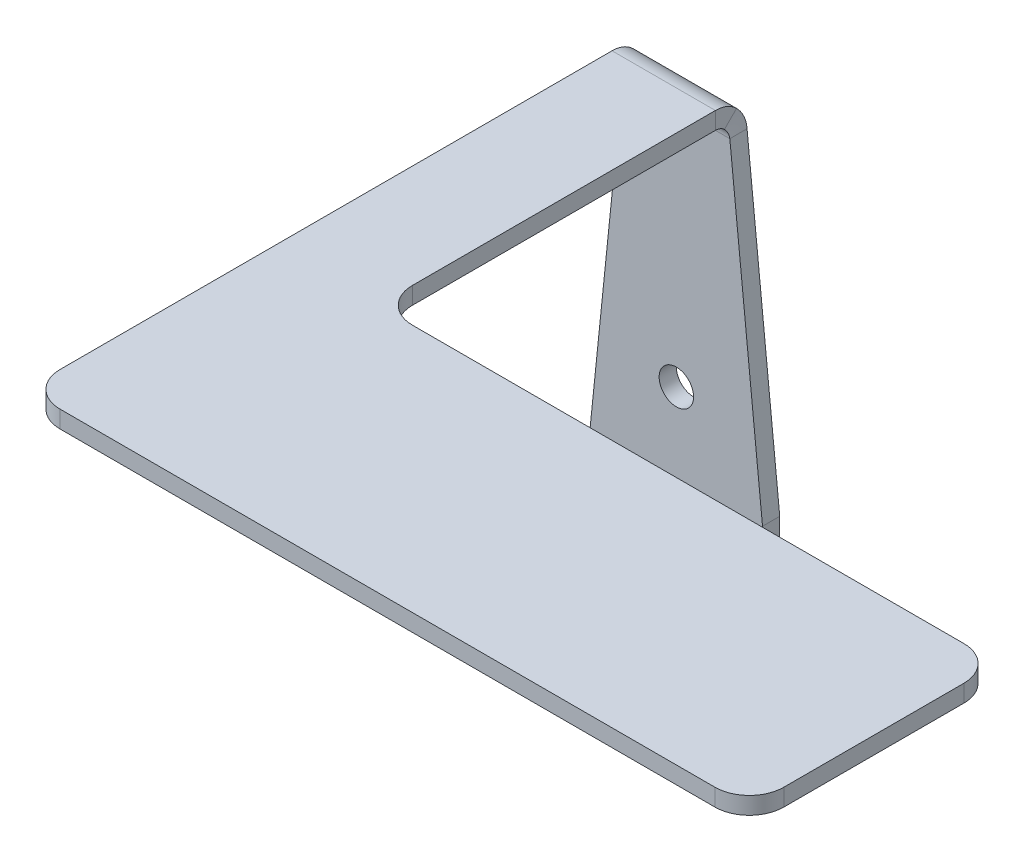
ISO-10303-21;
HEADER;
FILE_DESCRIPTION(('STEP AP214'),'2;1');
FILE_NAME('part.step','',(''),(''),'','','');
FILE_SCHEMA(('AUTOMOTIVE_DESIGN { 1 0 10303 214 1 1 1 1 }'));
ENDSEC;
DATA;
#1=APPLICATION_CONTEXT('core data for automotive mechanical design processes');
#2=APPLICATION_PROTOCOL_DEFINITION('international standard','automotive_design',2000,#1);
#3=PRODUCT_CONTEXT('',#1,'mechanical');
#4=PRODUCT('Part','Part','',(#3));
#5=PRODUCT_RELATED_PRODUCT_CATEGORY('part','',(#4));
#6=PRODUCT_DEFINITION_FORMATION('','',#4);
#7=PRODUCT_DEFINITION_CONTEXT('part definition',#1,'design');
#8=PRODUCT_DEFINITION('design','',#6,#7);
#9=PRODUCT_DEFINITION_SHAPE('','',#8);
#10=(LENGTH_UNIT() NAMED_UNIT(*) SI_UNIT(.MILLI.,.METRE.));
#11=(NAMED_UNIT(*) PLANE_ANGLE_UNIT() SI_UNIT($,.RADIAN.));
#12=(NAMED_UNIT(*) SI_UNIT($,.STERADIAN.) SOLID_ANGLE_UNIT());
#13=UNCERTAINTY_MEASURE_WITH_UNIT(LENGTH_MEASURE(1.E-05),#10,'distance_accuracy_value','');
#14=(GEOMETRIC_REPRESENTATION_CONTEXT(3) GLOBAL_UNCERTAINTY_ASSIGNED_CONTEXT((#13)) GLOBAL_UNIT_ASSIGNED_CONTEXT((#10,
#11,#12)) REPRESENTATION_CONTEXT('',''));
#15=CARTESIAN_POINT('',(0.,0.,0.));
#16=DIRECTION('',(0.,0.,1.));
#17=DIRECTION('',(1.,0.,0.));
#18=AXIS2_PLACEMENT_3D('',#15,#16,#17);
#19=CARTESIAN_POINT('',(42.1509861979315,14.5038150311188,32.7652042118766));
#20=DIRECTION('',(-1.,0.,0.));
#21=DIRECTION('',(0.,-1.,0.));
#22=AXIS2_PLACEMENT_3D('',#19,#20,#21);
#23=PLANE('',#22);
#24=DIRECTION('',(0.,0.,-1.));
#25=VECTOR('',#24,1.);
#26=CARTESIAN_POINT('',(42.1509861979315,14.5038150311188,32.7652042118766));
#27=LINE('',#26,#25);
#28=CARTESIAN_POINT('',(42.1509861979315,14.5038150311188,32.7652042118766));
#29=VERTEX_POINT('',#28);
#30=CARTESIAN_POINT('',(42.1509861979315,14.5038150311189,0.736600000000007));
#31=VERTEX_POINT('',#30);
#32=EDGE_CURVE('E164',#29,#31,#27,.T.);
#33=ORIENTED_EDGE('',*,*,#32,.T.);
#34=DIRECTION('',(0.,-1.,0.));
#35=VECTOR('',#34,1.);
#36=CARTESIAN_POINT('',(42.1509861979315,14.5038150311189,0.736600000000007));
#37=LINE('',#36,#35);
#38=CARTESIAN_POINT('',(42.1509861979315,13.5038150311189,0.736600000000001));
#39=VERTEX_POINT('',#38);
#40=EDGE_CURVE('E12',#31,#39,#37,.T.);
#41=ORIENTED_EDGE('',*,*,#40,.T.);
#42=DIRECTION('',(0.,0.,-1.));
#43=VECTOR('',#42,1.);
#44=CARTESIAN_POINT('',(42.1509861979315,13.5038150311188,32.7652042118766));
#45=LINE('',#44,#43);
#46=CARTESIAN_POINT('',(42.1509861979315,13.5038150311188,32.7652042118766));
#47=VERTEX_POINT('',#46);
#48=EDGE_CURVE('E191',#47,#39,#45,.T.);
#49=ORIENTED_EDGE('',*,*,#48,.F.);
#50=DIRECTION('',(0.,-1.,0.));
#51=VECTOR('',#50,1.);
#52=CARTESIAN_POINT('',(42.1509861979315,14.5038150311188,32.7652042118766));
#53=LINE('',#52,#51);
#54=EDGE_CURVE('E152',#29,#47,#53,.T.);
#55=ORIENTED_EDGE('',*,*,#54,.F.);
#56=EDGE_LOOP('',(#33,#41,#49,#55));
#57=FACE_BOUND('',#56,.T.);
#58=ADVANCED_FACE('F56',(#57),#23,.T.);
#59=CARTESIAN_POINT('',(48.1509861979315,14.5038150311188,18.319635118458));
#60=DIRECTION('',(1.,0.,0.));
#61=DIRECTION('',(0.,0.,1.));
#62=AXIS2_PLACEMENT_3D('',#59,#60,#61);
#63=PLANE('',#62);
#64=DIRECTION('',(0.,0.,1.));
#65=VECTOR('',#64,1.);
#66=CARTESIAN_POINT('',(48.1509861979315,13.5038150311188,18.319635118458));
#67=LINE('',#66,#65);
#68=CARTESIAN_POINT('',(48.1509861979315,13.5038150311189,0.736600000000001));
#69=VERTEX_POINT('',#68);
#70=CARTESIAN_POINT('',(48.1509861979315,13.5038150311188,18.319635118458));
#71=VERTEX_POINT('',#70);
#72=EDGE_CURVE('E115',#69,#71,#67,.T.);
#73=ORIENTED_EDGE('',*,*,#72,.F.);
#74=DIRECTION('',(0.,1.,0.));
#75=VECTOR('',#74,1.);
#76=CARTESIAN_POINT('',(48.1509861979315,14.5038150311189,0.736600000000006));
#77=LINE('',#76,#75);
#78=CARTESIAN_POINT('',(48.1509861979315,14.5038150311189,0.736600000000002));
#79=VERTEX_POINT('',#78);
#80=EDGE_CURVE('E205',#69,#79,#77,.T.);
#81=ORIENTED_EDGE('',*,*,#80,.T.);
#82=DIRECTION('',(0.,0.,1.));
#83=VECTOR('',#82,1.);
#84=CARTESIAN_POINT('',(48.1509861979315,14.5038150311188,18.319635118458));
#85=LINE('',#84,#83);
#86=CARTESIAN_POINT('',(48.1509861979315,14.5038150311188,18.319635118458));
#87=VERTEX_POINT('',#86);
#88=EDGE_CURVE('E59',#79,#87,#85,.T.);
#89=ORIENTED_EDGE('',*,*,#88,.T.);
#90=DIRECTION('',(0.,-1.,0.));
#91=VECTOR('',#90,1.);
#92=CARTESIAN_POINT('',(48.1509861979315,14.5038150311188,18.319635118458));
#93=LINE('',#92,#91);
#94=EDGE_CURVE('E192',#87,#71,#93,.T.);
#95=ORIENTED_EDGE('',*,*,#94,.T.);
#96=EDGE_LOOP('',(#73,#81,#89,#95));
#97=FACE_BOUND('',#96,.T.);
#98=ADVANCED_FACE('F240',(#97),#63,.T.);
#99=CARTESIAN_POINT('',(50.1509861979315,14.5038150311188,18.319635118458));
#100=DIRECTION('',(0.,1.,0.));
#101=DIRECTION('',(-1.,0.,0.));
#102=AXIS2_PLACEMENT_3D('',#99,#100,#101);
#103=PLANE('',#102);
#104=ORIENTED_EDGE('',*,*,#88,.F.);
#105=DIRECTION('',(-1.,0.,0.));
#106=VECTOR('',#105,1.);
#107=CARTESIAN_POINT('',(50.1509861979315,14.5038150311189,0.736600000000006));
#108=LINE('',#107,#106);
#109=EDGE_CURVE('E194',#79,#31,#108,.T.);
#110=ORIENTED_EDGE('',*,*,#109,.T.);
#111=ORIENTED_EDGE('',*,*,#32,.F.);
#112=CARTESIAN_POINT('',(44.1509861979315,14.5038150311188,32.7652042118766));
#113=DIRECTION('',(0.,-1.,0.));
#114=DIRECTION('',(-1.,0.,0.));
#115=AXIS2_PLACEMENT_3D('',#112,#113,#114);
#116=CIRCLE('',#115,2.);
#117=CARTESIAN_POINT('',(44.1509861979315,14.5038150311188,34.7652042118766));
#118=VERTEX_POINT('',#117);
#119=EDGE_CURVE('E145',#118,#29,#116,.T.);
#120=ORIENTED_EDGE('',*,*,#119,.F.);
#121=DIRECTION('',(-1.,0.,0.));
#122=VECTOR('',#121,1.);
#123=CARTESIAN_POINT('',(44.1509861979315,14.5038150311188,34.7652042118766));
#124=LINE('',#123,#122);
#125=CARTESIAN_POINT('',(82.1509861979315,14.5038150311188,34.7652042118766));
#126=VERTEX_POINT('',#125);
#127=EDGE_CURVE('E160',#126,#118,#124,.T.);
#128=ORIENTED_EDGE('',*,*,#127,.F.);
#129=CARTESIAN_POINT('',(82.1509861979315,14.5038150311188,32.7652042118766));
#130=DIRECTION('',(0.,-1.,0.));
#131=DIRECTION('',(-1.,0.,0.));
#132=AXIS2_PLACEMENT_3D('',#129,#130,#131);
#133=CIRCLE('',#132,2.);
#134=CARTESIAN_POINT('',(84.1509861979315,14.5038150311188,32.7652042118766));
#135=VERTEX_POINT('',#134);
#136=EDGE_CURVE('E167',#135,#126,#133,.T.);
#137=ORIENTED_EDGE('',*,*,#136,.F.);
#138=DIRECTION('',(0.,0.,1.));
#139=VECTOR('',#138,1.);
#140=CARTESIAN_POINT('',(84.1509861979315,14.5038150311188,32.7652042118766));
#141=LINE('',#140,#139);
#142=CARTESIAN_POINT('',(84.1509861979315,14.5038150311188,22.319635118458));
#143=VERTEX_POINT('',#142);
#144=EDGE_CURVE('E169',#143,#135,#141,.T.);
#145=ORIENTED_EDGE('',*,*,#144,.F.);
#146=CARTESIAN_POINT('',(82.1509861979315,14.5038150311188,22.319635118458));
#147=DIRECTION('',(0.,-1.,0.));
#148=DIRECTION('',(1.,0.,0.));
#149=AXIS2_PLACEMENT_3D('',#146,#147,#148);
#150=CIRCLE('',#149,2.);
#151=CARTESIAN_POINT('',(82.1509861979315,14.5038150311188,20.319635118458));
#152=VERTEX_POINT('',#151);
#153=EDGE_CURVE('E217',#152,#143,#150,.T.);
#154=ORIENTED_EDGE('',*,*,#153,.F.);
#155=DIRECTION('',(1.,0.,0.));
#156=VECTOR('',#155,1.);
#157=CARTESIAN_POINT('',(82.1509861979315,14.5038150311188,20.319635118458));
#158=LINE('',#157,#156);
#159=CARTESIAN_POINT('',(50.1509861979315,14.5038150311188,20.319635118458));
#160=VERTEX_POINT('',#159);
#161=EDGE_CURVE('E213',#160,#152,#158,.T.);
#162=ORIENTED_EDGE('',*,*,#161,.F.);
#163=CARTESIAN_POINT('',(50.1509861979315,14.5038150311188,18.319635118458));
#164=DIRECTION('',(0.,1.,0.));
#165=DIRECTION('',(-1.,0.,0.));
#166=AXIS2_PLACEMENT_3D('',#163,#164,#165);
#167=CIRCLE('',#166,2.);
#168=EDGE_CURVE('E211',#87,#160,#167,.T.);
#169=ORIENTED_EDGE('',*,*,#168,.F.);
#170=EDGE_LOOP('',(#104,#110,#111,#120,#128,#137,#145,#154,#162,#169));
#171=FACE_BOUND('',#170,.T.);
#172=ADVANCED_FACE('F158',(#171),#103,.T.);
#173=CARTESIAN_POINT('',(50.1509861979315,14.5038150311188,18.319635118458));
#174=DIRECTION('',(0.,-1.,0.));
#175=DIRECTION('',(1.,0.,0.));
#176=AXIS2_PLACEMENT_3D('',#173,#174,#175);
#177=CYLINDRICAL_SURFACE('',#176,2.);
#178=CARTESIAN_POINT('',(50.1509861979315,13.5038150311188,18.319635118458));
#179=DIRECTION('',(0.,1.,0.));
#180=DIRECTION('',(-1.,0.,0.));
#181=AXIS2_PLACEMENT_3D('',#178,#179,#180);
#182=CIRCLE('',#181,2.);
#183=CARTESIAN_POINT('',(50.1509861979315,13.5038150311188,20.319635118458));
#184=VERTEX_POINT('',#183);
#185=EDGE_CURVE('E173',#71,#184,#182,.T.);
#186=ORIENTED_EDGE('',*,*,#185,.F.);
#187=ORIENTED_EDGE('',*,*,#94,.F.);
#188=ORIENTED_EDGE('',*,*,#168,.T.);
#189=DIRECTION('',(0.,-1.,0.));
#190=VECTOR('',#189,1.);
#191=CARTESIAN_POINT('',(50.1509861979315,14.5038150311188,20.319635118458));
#192=LINE('',#191,#190);
#193=EDGE_CURVE('E122',#160,#184,#192,.T.);
#194=ORIENTED_EDGE('',*,*,#193,.T.);
#195=EDGE_LOOP('',(#186,#187,#188,#194));
#196=FACE_BOUND('',#195,.T.);
#197=ADVANCED_FACE('F459',(#196),#177,.F.);
#198=CARTESIAN_POINT('',(44.1509861979315,14.5038150311188,32.7652042118766));
#199=DIRECTION('',(0.,-1.,0.));
#200=DIRECTION('',(1.,0.,0.));
#201=AXIS2_PLACEMENT_3D('',#198,#199,#200);
#202=CYLINDRICAL_SURFACE('',#201,2.);
#203=CARTESIAN_POINT('',(44.1509861979315,13.5038150311188,32.7652042118766));
#204=DIRECTION('',(0.,-1.,0.));
#205=DIRECTION('',(-1.,0.,0.));
#206=AXIS2_PLACEMENT_3D('',#203,#204,#205);
#207=CIRCLE('',#206,2.);
#208=CARTESIAN_POINT('',(44.1509861979315,13.5038150311188,34.7652042118766));
#209=VERTEX_POINT('',#208);
#210=EDGE_CURVE('E147',#209,#47,#207,.T.);
#211=ORIENTED_EDGE('',*,*,#210,.F.);
#212=DIRECTION('',(0.,-1.,0.));
#213=VECTOR('',#212,1.);
#214=CARTESIAN_POINT('',(44.1509861979315,14.5038150311188,34.7652042118766));
#215=LINE('',#214,#213);
#216=EDGE_CURVE('E142',#118,#209,#215,.T.);
#217=ORIENTED_EDGE('',*,*,#216,.F.);
#218=ORIENTED_EDGE('',*,*,#119,.T.);
#219=ORIENTED_EDGE('',*,*,#54,.T.);
#220=EDGE_LOOP('',(#211,#217,#218,#219));
#221=FACE_BOUND('',#220,.T.);
#222=ADVANCED_FACE('F144',(#221),#202,.T.);
#223=CARTESIAN_POINT('',(44.1509861979315,14.5038150311188,34.7652042118766));
#224=DIRECTION('',(0.,0.,1.));
#225=DIRECTION('',(-1.,0.,0.));
#226=AXIS2_PLACEMENT_3D('',#223,#224,#225);
#227=PLANE('',#226);
#228=DIRECTION('',(-1.,0.,0.));
#229=VECTOR('',#228,1.);
#230=CARTESIAN_POINT('',(44.1509861979315,13.5038150311188,34.7652042118766));
#231=LINE('',#230,#229);
#232=CARTESIAN_POINT('',(82.1509861979315,13.5038150311188,34.7652042118766));
#233=VERTEX_POINT('',#232);
#234=EDGE_CURVE('E188',#233,#209,#231,.T.);
#235=ORIENTED_EDGE('',*,*,#234,.F.);
#236=DIRECTION('',(0.,-1.,0.));
#237=VECTOR('',#236,1.);
#238=CARTESIAN_POINT('',(82.1509861979315,14.5038150311188,34.7652042118766));
#239=LINE('',#238,#237);
#240=EDGE_CURVE('E153',#126,#233,#239,.T.);
#241=ORIENTED_EDGE('',*,*,#240,.F.);
#242=ORIENTED_EDGE('',*,*,#127,.T.);
#243=ORIENTED_EDGE('',*,*,#216,.T.);
#244=EDGE_LOOP('',(#235,#241,#242,#243));
#245=FACE_BOUND('',#244,.T.);
#246=ADVANCED_FACE('F166',(#245),#227,.T.);
#247=CARTESIAN_POINT('',(82.1509861979315,14.5038150311188,32.7652042118766));
#248=DIRECTION('',(0.,-1.,0.));
#249=DIRECTION('',(1.,0.,0.));
#250=AXIS2_PLACEMENT_3D('',#247,#248,#249);
#251=CYLINDRICAL_SURFACE('',#250,2.);
#252=CARTESIAN_POINT('',(82.1509861979315,13.5038150311188,32.7652042118766));
#253=DIRECTION('',(0.,-1.,0.));
#254=DIRECTION('',(-1.,0.,0.));
#255=AXIS2_PLACEMENT_3D('',#252,#253,#254);
#256=CIRCLE('',#255,2.);
#257=CARTESIAN_POINT('',(84.1509861979315,13.5038150311188,32.7652042118766));
#258=VERTEX_POINT('',#257);
#259=EDGE_CURVE('E185',#258,#233,#256,.T.);
#260=ORIENTED_EDGE('',*,*,#259,.F.);
#261=DIRECTION('',(0.,-1.,0.));
#262=VECTOR('',#261,1.);
#263=CARTESIAN_POINT('',(84.1509861979315,14.5038150311188,32.7652042118766));
#264=LINE('',#263,#262);
#265=EDGE_CURVE('E197',#135,#258,#264,.T.);
#266=ORIENTED_EDGE('',*,*,#265,.F.);
#267=ORIENTED_EDGE('',*,*,#136,.T.);
#268=ORIENTED_EDGE('',*,*,#240,.T.);
#269=EDGE_LOOP('',(#260,#266,#267,#268));
#270=FACE_BOUND('',#269,.T.);
#271=ADVANCED_FACE('F462',(#270),#251,.T.);
#272=CARTESIAN_POINT('',(84.1509861979315,14.5038150311188,32.7652042118766));
#273=DIRECTION('',(1.,0.,0.));
#274=DIRECTION('',(0.,1.,0.));
#275=AXIS2_PLACEMENT_3D('',#272,#273,#274);
#276=PLANE('',#275);
#277=DIRECTION('',(0.,0.,1.));
#278=VECTOR('',#277,1.);
#279=CARTESIAN_POINT('',(84.1509861979315,13.5038150311188,32.7652042118766));
#280=LINE('',#279,#278);
#281=CARTESIAN_POINT('',(84.1509861979315,13.5038150311188,22.319635118458));
#282=VERTEX_POINT('',#281);
#283=EDGE_CURVE('E182',#282,#258,#280,.T.);
#284=ORIENTED_EDGE('',*,*,#283,.F.);
#285=DIRECTION('',(0.,-1.,0.));
#286=VECTOR('',#285,1.);
#287=CARTESIAN_POINT('',(84.1509861979315,14.5038150311188,22.319635118458));
#288=LINE('',#287,#286);
#289=EDGE_CURVE('E199',#143,#282,#288,.T.);
#290=ORIENTED_EDGE('',*,*,#289,.F.);
#291=ORIENTED_EDGE('',*,*,#144,.T.);
#292=ORIENTED_EDGE('',*,*,#265,.T.);
#293=EDGE_LOOP('',(#284,#290,#291,#292));
#294=FACE_BOUND('',#293,.T.);
#295=ADVANCED_FACE('F228',(#294),#276,.T.);
#296=CARTESIAN_POINT('',(82.1509861979315,14.5038150311188,22.319635118458));
#297=DIRECTION('',(0.,-1.,0.));
#298=DIRECTION('',(1.,0.,0.));
#299=AXIS2_PLACEMENT_3D('',#296,#297,#298);
#300=CYLINDRICAL_SURFACE('',#299,2.);
#301=CARTESIAN_POINT('',(82.1509861979315,13.5038150311188,22.319635118458));
#302=DIRECTION('',(0.,-1.,0.));
#303=DIRECTION('',(1.,0.,0.));
#304=AXIS2_PLACEMENT_3D('',#301,#302,#303);
#305=CIRCLE('',#304,2.);
#306=CARTESIAN_POINT('',(82.1509861979315,13.5038150311188,20.319635118458));
#307=VERTEX_POINT('',#306);
#308=EDGE_CURVE('E179',#307,#282,#305,.T.);
#309=ORIENTED_EDGE('',*,*,#308,.F.);
#310=DIRECTION('',(0.,-1.,0.));
#311=VECTOR('',#310,1.);
#312=CARTESIAN_POINT('',(82.1509861979315,14.5038150311188,20.319635118458));
#313=LINE('',#312,#311);
#314=EDGE_CURVE('E201',#152,#307,#313,.T.);
#315=ORIENTED_EDGE('',*,*,#314,.F.);
#316=ORIENTED_EDGE('',*,*,#153,.T.);
#317=ORIENTED_EDGE('',*,*,#289,.T.);
#318=EDGE_LOOP('',(#309,#315,#316,#317));
#319=FACE_BOUND('',#318,.T.);
#320=ADVANCED_FACE('F233',(#319),#300,.T.);
#321=CARTESIAN_POINT('',(82.1509861979315,14.5038150311188,20.319635118458));
#322=DIRECTION('',(0.,0.,-1.));
#323=DIRECTION('',(1.,0.,0.));
#324=AXIS2_PLACEMENT_3D('',#321,#322,#323);
#325=PLANE('',#324);
#326=DIRECTION('',(1.,0.,0.));
#327=VECTOR('',#326,1.);
#328=CARTESIAN_POINT('',(82.1509861979315,13.5038150311188,20.319635118458));
#329=LINE('',#328,#327);
#330=EDGE_CURVE('E175',#184,#307,#329,.T.);
#331=ORIENTED_EDGE('',*,*,#330,.F.);
#332=ORIENTED_EDGE('',*,*,#193,.F.);
#333=ORIENTED_EDGE('',*,*,#161,.T.);
#334=ORIENTED_EDGE('',*,*,#314,.T.);
#335=EDGE_LOOP('',(#331,#332,#333,#334));
#336=FACE_BOUND('',#335,.T.);
#337=ADVANCED_FACE('F234',(#336),#325,.T.);
#338=CARTESIAN_POINT('',(50.1509861979315,13.5038150311188,18.319635118458));
#339=DIRECTION('',(0.,1.,0.));
#340=DIRECTION('',(-1.,0.,0.));
#341=AXIS2_PLACEMENT_3D('',#338,#339,#340);
#342=PLANE('',#341);
#343=DIRECTION('',(-1.,0.,0.));
#344=VECTOR('',#343,1.);
#345=CARTESIAN_POINT('',(50.1509861979315,13.5038150311189,0.736600000000002));
#346=LINE('',#345,#344);
#347=EDGE_CURVE('E64',#69,#39,#346,.T.);
#348=ORIENTED_EDGE('',*,*,#347,.F.);
#349=ORIENTED_EDGE('',*,*,#72,.T.);
#350=ORIENTED_EDGE('',*,*,#185,.T.);
#351=ORIENTED_EDGE('',*,*,#330,.T.);
#352=ORIENTED_EDGE('',*,*,#308,.T.);
#353=ORIENTED_EDGE('',*,*,#283,.T.);
#354=ORIENTED_EDGE('',*,*,#259,.T.);
#355=ORIENTED_EDGE('',*,*,#234,.T.);
#356=ORIENTED_EDGE('',*,*,#210,.T.);
#357=ORIENTED_EDGE('',*,*,#48,.T.);
#358=EDGE_LOOP('',(#348,#349,#350,#351,#352,#353,#354,#355,#356,#357));
#359=FACE_BOUND('',#358,.T.);
#360=ADVANCED_FACE('F380',(#359),#342,.F.);
#361=CARTESIAN_POINT('',(45.1482089892891,-13.7615616000238,-1.));
#362=DIRECTION('',(0.,0.,1.));
#363=DIRECTION('',(1.,0.,0.));
#364=AXIS2_PLACEMENT_3D('',#361,#362,#363);
#365=CYLINDRICAL_SURFACE('',#364,1.3999999999584);
#366=CARTESIAN_POINT('',(45.1482089892891,-13.7615616000238,-1.));
#367=DIRECTION('',(0.,0.,1.));
#368=DIRECTION('',(1.,0.,0.));
#369=AXIS2_PLACEMENT_3D('',#366,#367,#368);
#370=CIRCLE('',#369,1.3999999999584);
#371=CARTESIAN_POINT('',(46.5482089892475,-13.7615616000238,-1.));
#372=VERTEX_POINT('',#371);
#373=EDGE_CURVE('E528',#372,#372,#370,.T.);
#374=ORIENTED_EDGE('',*,*,#373,.F.);
#375=EDGE_LOOP('',(#374));
#376=FACE_BOUND('',#375,.T.);
#377=CARTESIAN_POINT('',(45.1482089892891,-13.7615616000238,0.));
#378=DIRECTION('',(0.,0.,1.));
#379=DIRECTION('',(1.,0.,0.));
#380=AXIS2_PLACEMENT_3D('',#377,#378,#379);
#381=CIRCLE('',#380,1.3999999999584);
#382=CARTESIAN_POINT('',(46.5482089892475,-13.7615616000238,0.));
#383=VERTEX_POINT('',#382);
#384=EDGE_CURVE('E533',#383,#383,#381,.T.);
#385=ORIENTED_EDGE('',*,*,#384,.T.);
#386=EDGE_LOOP('',(#385));
#387=FACE_BOUND('',#386,.T.);
#388=ADVANCED_FACE('F376',(#376,#387),#365,.F.);
#389=CARTESIAN_POINT('',(45.1482089892891,-1.26156160002384,-1.));
#390=DIRECTION('',(0.,0.,1.));
#391=DIRECTION('',(1.,0.,0.));
#392=AXIS2_PLACEMENT_3D('',#389,#390,#391);
#393=CYLINDRICAL_SURFACE('',#392,0.9999999999584);
#394=CARTESIAN_POINT('',(45.1482089892891,-1.26156160002384,-1.));
#395=DIRECTION('',(0.,0.,1.));
#396=DIRECTION('',(1.,0.,0.));
#397=AXIS2_PLACEMENT_3D('',#394,#395,#396);
#398=CIRCLE('',#397,0.9999999999584);
#399=CARTESIAN_POINT('',(46.1482089892475,-1.26156160002384,-1.));
#400=VERTEX_POINT('',#399);
#401=EDGE_CURVE('E815',#400,#400,#398,.T.);
#402=ORIENTED_EDGE('',*,*,#401,.F.);
#403=EDGE_LOOP('',(#402));
#404=FACE_BOUND('',#403,.T.);
#405=CARTESIAN_POINT('',(45.1482089892891,-1.26156160002384,0.));
#406=DIRECTION('',(0.,0.,1.));
#407=DIRECTION('',(1.,0.,0.));
#408=AXIS2_PLACEMENT_3D('',#405,#406,#407);
#409=CIRCLE('',#408,0.9999999999584);
#410=CARTESIAN_POINT('',(46.1482089892475,-1.26156160002384,0.));
#411=VERTEX_POINT('',#410);
#412=EDGE_CURVE('E799',#411,#411,#409,.T.);
#413=ORIENTED_EDGE('',*,*,#412,.T.);
#414=EDGE_LOOP('',(#413));
#415=FACE_BOUND('',#414,.T.);
#416=ADVANCED_FACE('F379',(#404,#415),#393,.F.);
#417=CARTESIAN_POINT('',(40.1482089892891,-5.76156160002383,-1.));
#418=DIRECTION('',(-1.,0.,0.));
#419=DIRECTION('',(0.,0.,1.));
#420=AXIS2_PLACEMENT_3D('',#417,#418,#419);
#421=PLANE('',#420);
#422=DIRECTION('',(0.,-1.,0.));
#423=VECTOR('',#422,1.);
#424=CARTESIAN_POINT('',(40.1482089892891,-5.76156160002383,0.));
#425=LINE('',#424,#423);
#426=CARTESIAN_POINT('',(40.1482089892891,-5.76156160002383,0.));
#427=VERTEX_POINT('',#426);
#428=CARTESIAN_POINT('',(40.1482089892891,-15.7615616000238,0.));
#429=VERTEX_POINT('',#428);
#430=EDGE_CURVE('E434',#427,#429,#425,.T.);
#431=ORIENTED_EDGE('',*,*,#430,.F.);
#432=DIRECTION('',(0.,0.,1.));
#433=VECTOR('',#432,1.);
#434=CARTESIAN_POINT('',(40.1482089892891,-5.76156160002383,-1.));
#435=LINE('',#434,#433);
#436=CARTESIAN_POINT('',(40.1482089892891,-5.76156160002383,-1.));
#437=VERTEX_POINT('',#436);
#438=EDGE_CURVE('E176',#437,#427,#435,.T.);
#439=ORIENTED_EDGE('',*,*,#438,.F.);
#440=DIRECTION('',(0.,-1.,0.));
#441=VECTOR('',#440,1.);
#442=CARTESIAN_POINT('',(40.1482089892891,-5.76156160002383,-1.));
#443=LINE('',#442,#441);
#444=CARTESIAN_POINT('',(40.1482089892891,-15.7615616000238,-1.));
#445=VERTEX_POINT('',#444);
#446=EDGE_CURVE('E828',#437,#445,#443,.T.);
#447=ORIENTED_EDGE('',*,*,#446,.T.);
#448=DIRECTION('',(0.,0.,1.));
#449=VECTOR('',#448,1.);
#450=CARTESIAN_POINT('',(40.1482089892891,-15.7615616000238,-1.));
#451=LINE('',#450,#449);
#452=EDGE_CURVE('E826',#445,#429,#451,.T.);
#453=ORIENTED_EDGE('',*,*,#452,.T.);
#454=EDGE_LOOP('',(#431,#439,#447,#453));
#455=FACE_BOUND('',#454,.T.);
#456=ADVANCED_FACE('F384',(#455),#421,.T.);
#457=CARTESIAN_POINT('',(45.1482089892891,-13.7615616000238,-1.));
#458=DIRECTION('',(0.,0.,1.));
#459=DIRECTION('',(1.,0.,0.));
#460=AXIS2_PLACEMENT_3D('',#457,#458,#459);
#461=CYLINDRICAL_SURFACE('',#460,5.3851648071345);
#462=CARTESIAN_POINT('',(45.1482089892891,-13.7615616000238,0.));
#463=DIRECTION('',(0.,0.,1.));
#464=DIRECTION('',(1.,0.,0.));
#465=AXIS2_PLACEMENT_3D('',#462,#463,#464);
#466=CIRCLE('',#465,5.3851648071345);
#467=CARTESIAN_POINT('',(50.1482089892891,-15.7615616000238,0.));
#468=VERTEX_POINT('',#467);
#469=EDGE_CURVE('E809',#429,#468,#466,.T.);
#470=ORIENTED_EDGE('',*,*,#469,.F.);
#471=ORIENTED_EDGE('',*,*,#452,.F.);
#472=CARTESIAN_POINT('',(45.1482089892891,-13.7615616000238,-1.));
#473=DIRECTION('',(0.,0.,1.));
#474=DIRECTION('',(1.,0.,0.));
#475=AXIS2_PLACEMENT_3D('',#472,#473,#474);
#476=CIRCLE('',#475,5.3851648071345);
#477=CARTESIAN_POINT('',(50.1482089892891,-15.7615616000238,-1.));
#478=VERTEX_POINT('',#477);
#479=EDGE_CURVE('E823',#445,#478,#476,.T.);
#480=ORIENTED_EDGE('',*,*,#479,.T.);
#481=DIRECTION('',(0.,0.,1.));
#482=VECTOR('',#481,1.);
#483=CARTESIAN_POINT('',(50.1482089892891,-15.7615616000238,-1.));
#484=LINE('',#483,#482);
#485=EDGE_CURVE('E821',#478,#468,#484,.T.);
#486=ORIENTED_EDGE('',*,*,#485,.T.);
#487=EDGE_LOOP('',(#470,#471,#480,#486));
#488=FACE_BOUND('',#487,.T.);
#489=ADVANCED_FACE('F388',(#488),#461,.T.);
#490=CARTESIAN_POINT('',(50.1482089892891,-5.76156160002383,-1.));
#491=DIRECTION('',(1.,0.,0.));
#492=DIRECTION('',(0.,0.,-1.));
#493=AXIS2_PLACEMENT_3D('',#490,#491,#492);
#494=PLANE('',#493);
#495=DIRECTION('',(0.,1.,0.));
#496=VECTOR('',#495,1.);
#497=CARTESIAN_POINT('',(50.1482089892891,-5.76156160002383,0.));
#498=LINE('',#497,#496);
#499=CARTESIAN_POINT('',(50.1482089892891,-5.76156160002383,0.));
#500=VERTEX_POINT('',#499);
#501=EDGE_CURVE('E806',#468,#500,#498,.T.);
#502=ORIENTED_EDGE('',*,*,#501,.F.);
#503=ORIENTED_EDGE('',*,*,#485,.F.);
#504=DIRECTION('',(0.,1.,0.));
#505=VECTOR('',#504,1.);
#506=CARTESIAN_POINT('',(50.1482089892891,-5.76156160002383,-1.));
#507=LINE('',#506,#505);
#508=CARTESIAN_POINT('',(50.1482089892891,-5.76156160002383,-1.));
#509=VERTEX_POINT('',#508);
#510=EDGE_CURVE('E819',#478,#509,#507,.T.);
#511=ORIENTED_EDGE('',*,*,#510,.T.);
#512=DIRECTION('',(0.,0.,1.));
#513=VECTOR('',#512,1.);
#514=CARTESIAN_POINT('',(50.1482089892891,-5.76156160002383,-1.));
#515=LINE('',#514,#513);
#516=EDGE_CURVE('E525',#509,#500,#515,.T.);
#517=ORIENTED_EDGE('',*,*,#516,.T.);
#518=EDGE_LOOP('',(#502,#503,#511,#517));
#519=FACE_BOUND('',#518,.T.);
#520=ADVANCED_FACE('F392',(#519),#494,.T.);
#521=CARTESIAN_POINT('',(50.1509861979315,32.2926968872914,-1.));
#522=DIRECTION('',(0.,0.,-1.));
#523=DIRECTION('',(-1.,0.,0.));
#524=AXIS2_PLACEMENT_3D('',#521,#522,#523);
#525=PLANE('',#524);
#526=DIRECTION('',(-1.,0.,0.));
#527=VECTOR('',#526,1.);
#528=CARTESIAN_POINT('',(50.1509861979315,12.7672150311189,-1.));
#529=LINE('',#528,#527);
#530=CARTESIAN_POINT('',(48.250460528587,12.7672150311189,-1.));
#531=VERTEX_POINT('',#530);
#532=CARTESIAN_POINT('',(42.0512352221547,12.7672150311189,-1.));
#533=VERTEX_POINT('',#532);
#534=EDGE_CURVE('E530',#531,#533,#529,.T.);
#535=ORIENTED_EDGE('',*,*,#534,.F.);
#536=DIRECTION('',(-0.101888659585818,0.994795808720466,0.));
#537=VECTOR('',#536,1.);
#538=CARTESIAN_POINT('',(50.1482089892891,-5.76156160002383,-1.));
#539=LINE('',#538,#537);
#540=EDGE_CURVE('E429',#509,#531,#539,.T.);
#541=ORIENTED_EDGE('',*,*,#540,.F.);
#542=ORIENTED_EDGE('',*,*,#510,.F.);
#543=ORIENTED_EDGE('',*,*,#479,.F.);
#544=ORIENTED_EDGE('',*,*,#446,.F.);
#545=DIRECTION('',(-0.102169065331331,-0.994767049157401,0.));
#546=VECTOR('',#545,1.);
#547=CARTESIAN_POINT('',(40.1482089892891,-5.76156160002383,-1.));
#548=LINE('',#547,#546);
#549=EDGE_CURVE('E447',#533,#437,#548,.T.);
#550=ORIENTED_EDGE('',*,*,#549,.F.);
#551=EDGE_LOOP('',(#535,#541,#542,#543,#544,#550));
#552=FACE_BOUND('',#551,.T.);
#553=ORIENTED_EDGE('',*,*,#401,.T.);
#554=EDGE_LOOP('',(#553));
#555=FACE_BOUND('',#554,.T.);
#556=ORIENTED_EDGE('',*,*,#373,.T.);
#557=EDGE_LOOP('',(#556));
#558=FACE_BOUND('',#557,.T.);
#559=ADVANCED_FACE('F396',(#552,#555,#558),#525,.T.);
#560=CARTESIAN_POINT('',(50.1482089892891,-5.76156160002383,-1.));
#561=DIRECTION('',(0.994795808720466,0.101888659585818,0.));
#562=DIRECTION('',(-0.101888659585818,0.994795808720466,0.));
#563=AXIS2_PLACEMENT_3D('',#560,#561,#562);
#564=PLANE('',#563);
#565=CARTESIAN_POINT('',(48.250460528587,12.7672150311189,0.));
#566=CARTESIAN_POINT('',(48.250460528587,12.7672150311189,-1.));
#567=B_SPLINE_CURVE_WITH_KNOTS('',1,(#565,#566),.UNSPECIFIED.,.F.,.F.,(2,2),(0.,1.),.UNSPECIFIED.);
#568=CARTESIAN_POINT('',(48.250460528587,12.7672150311189,0.));
#569=VERTEX_POINT('',#568);
#570=EDGE_CURVE('E524',#569,#531,#567,.T.);
#571=ORIENTED_EDGE('',*,*,#570,.F.);
#572=DIRECTION('',(-0.101888659585818,0.994795808720466,0.));
#573=VECTOR('',#572,1.);
#574=CARTESIAN_POINT('',(50.1482089892891,-5.76156160002383,0.));
#575=LINE('',#574,#573);
#576=EDGE_CURVE('E424',#500,#569,#575,.T.);
#577=ORIENTED_EDGE('',*,*,#576,.F.);
#578=ORIENTED_EDGE('',*,*,#516,.F.);
#579=ORIENTED_EDGE('',*,*,#540,.T.);
#580=EDGE_LOOP('',(#571,#577,#578,#579));
#581=FACE_BOUND('',#580,.T.);
#582=ADVANCED_FACE('F400',(#581),#564,.T.);
#583=CARTESIAN_POINT('',(50.1509861979315,32.2926968872914,0.));
#584=DIRECTION('',(0.,0.,-1.));
#585=DIRECTION('',(-1.,0.,0.));
#586=AXIS2_PLACEMENT_3D('',#583,#584,#585);
#587=PLANE('',#586);
#588=ORIENTED_EDGE('',*,*,#412,.F.);
#589=EDGE_LOOP('',(#588));
#590=FACE_BOUND('',#589,.T.);
#591=ORIENTED_EDGE('',*,*,#384,.F.);
#592=EDGE_LOOP('',(#591));
#593=FACE_BOUND('',#592,.T.);
#594=ORIENTED_EDGE('',*,*,#576,.T.);
#595=DIRECTION('',(-1.,0.,0.));
#596=VECTOR('',#595,1.);
#597=CARTESIAN_POINT('',(50.1509861979315,12.7672150311189,0.));
#598=LINE('',#597,#596);
#599=CARTESIAN_POINT('',(42.0512352221547,12.7672150311189,0.));
#600=VERTEX_POINT('',#599);
#601=EDGE_CURVE('E415',#569,#600,#598,.T.);
#602=ORIENTED_EDGE('',*,*,#601,.T.);
#603=DIRECTION('',(-0.102169065331331,-0.994767049157401,0.));
#604=VECTOR('',#603,1.);
#605=CARTESIAN_POINT('',(40.1482089892891,-5.76156160002383,0.));
#606=LINE('',#605,#604);
#607=EDGE_CURVE('E423',#600,#427,#606,.T.);
#608=ORIENTED_EDGE('',*,*,#607,.T.);
#609=ORIENTED_EDGE('',*,*,#430,.T.);
#610=ORIENTED_EDGE('',*,*,#469,.T.);
#611=ORIENTED_EDGE('',*,*,#501,.T.);
#612=EDGE_LOOP('',(#594,#602,#608,#609,#610,#611));
#613=FACE_BOUND('',#612,.T.);
#614=ADVANCED_FACE('F405',(#590,#593,#613),#587,.F.);
#615=CARTESIAN_POINT('',(40.1482089892891,-5.76156160002383,-1.));
#616=DIRECTION('',(-0.994767049157401,0.102169065331331,0.));
#617=DIRECTION('',(-0.102169065331331,-0.994767049157401,0.));
#618=AXIS2_PLACEMENT_3D('',#615,#616,#617);
#619=PLANE('',#618);
#620=CARTESIAN_POINT('',(42.0512352221547,12.7672150311189,-1.));
#621=CARTESIAN_POINT('',(42.0512352221547,12.7672150311189,0.));
#622=B_SPLINE_CURVE_WITH_KNOTS('',1,(#620,#621),.UNSPECIFIED.,.F.,.F.,(2,2),(0.,1.),.UNSPECIFIED.);
#623=EDGE_CURVE('E443',#533,#600,#622,.T.);
#624=ORIENTED_EDGE('',*,*,#623,.F.);
#625=ORIENTED_EDGE('',*,*,#549,.T.);
#626=ORIENTED_EDGE('',*,*,#438,.T.);
#627=ORIENTED_EDGE('',*,*,#607,.F.);
#628=EDGE_LOOP('',(#624,#625,#626,#627));
#629=FACE_BOUND('',#628,.T.);
#630=ADVANCED_FACE('F448',(#629),#619,.T.);
#631=CARTESIAN_POINT('',(48.1509861979315,12.7672150311189,0.7366));
#632=DIRECTION('',(1.,0.,0.));
#633=DIRECTION('',(0.,0.,-1.));
#634=AXIS2_PLACEMENT_3D('',#631,#632,#633);
#635=PLANE('',#634);
#636=ORIENTED_EDGE('',*,*,#80,.F.);
#637=CARTESIAN_POINT('',(48.1509861979315,12.7672150311189,0.7366));
#638=DIRECTION('',(1.,0.,0.));
#639=DIRECTION('',(0.,1.,0.));
#640=AXIS2_PLACEMENT_3D('',#637,#638,#639);
#641=CIRCLE('',#640,0.7366);
#642=CARTESIAN_POINT('',(48.1509861979315,13.2880698861409,0.215745144977989));
#643=VERTEX_POINT('',#642);
#644=EDGE_CURVE('E249',#69,#643,#641,.F.);
#645=ORIENTED_EDGE('',*,*,#644,.T.);
#646=CARTESIAN_POINT('',(48.1509861979315,13.9951766673274,-0.491361636208561));
#647=CARTESIAN_POINT('',(48.1509861979315,13.2880698861409,0.215745144977988));
#648=B_SPLINE_CURVE_WITH_KNOTS('',1,(#646,#647),.UNSPECIFIED.,.F.,.F.,(2,2),(0.,1.),.UNSPECIFIED.);
#649=CARTESIAN_POINT('',(48.1509861979315,13.9951766673274,-0.49136163620856));
#650=VERTEX_POINT('',#649);
#651=EDGE_CURVE('E327',#643,#650,#648,.F.);
#652=ORIENTED_EDGE('',*,*,#651,.T.);
#653=CARTESIAN_POINT('',(48.1509861979315,12.7672150311189,0.7366));
#654=DIRECTION('',(-1.,0.,0.));
#655=DIRECTION('',(0.,0.,-1.));
#656=AXIS2_PLACEMENT_3D('',#653,#654,#655);
#657=CIRCLE('',#656,1.7366);
#658=EDGE_CURVE('E251',#79,#650,#657,.T.);
#659=ORIENTED_EDGE('',*,*,#658,.F.);
#660=EDGE_LOOP('',(#636,#645,#652,#659));
#661=FACE_BOUND('',#660,.T.);
#662=ADVANCED_FACE('F246',(#661),#635,.T.);
#663=CARTESIAN_POINT('',(48.1509861979315,13.9951766673274,-0.491361636208561));
#664=CARTESIAN_POINT('',(48.1675682263836,13.8344080374172,-0.652130266118805));
#665=CARTESIAN_POINT('',(48.18414430815,13.641799752431,-0.780817442016006));
#666=CARTESIAN_POINT('',(48.2173024183685,13.2217664070972,-0.954800950302197));
#667=CARTESIAN_POINT('',(48.2338785001349,12.9945762079421,-1.));
#668=CARTESIAN_POINT('',(48.250460528587,12.7672150311189,-1.));
#669=CARTESIAN_POINT('',(48.1509861979315,13.2880698861409,0.215745144977988));
#670=CARTESIAN_POINT('',(48.1675681563624,13.2198782054266,0.147553464263664));
#671=CARTESIAN_POINT('',(48.18414430815,13.1381807720601,0.092968946338253));
#672=CARTESIAN_POINT('',(48.2173024183685,12.9600185227379,0.0191717263661185));
#673=CARTESIAN_POINT('',(48.2338785701561,12.8636526308261,0.));
#674=CARTESIAN_POINT('',(48.250460528587,12.7672150311189,0.));
#675=B_SPLINE_SURFACE_WITH_KNOTS('',1,3,((#663,#664,#665,#666,#667,#668),(#669,#670,#671,#672,
#673,#674)),.UNSPECIFIED.,.F.,.F.,.F.,(2,2),(4,2,4),(0.,1.),(0.,0.5,1.),.UNSPECIFIED.);
#676=CARTESIAN_POINT('',(48.1509861979315,13.2880698861409,0.215745144977988));
#677=CARTESIAN_POINT('',(48.1675681563624,13.2198782054266,0.147553464263664));
#678=CARTESIAN_POINT('',(48.18414430815,13.1381807720601,0.092968946338253));
#679=CARTESIAN_POINT('',(48.2173024183685,12.9600185227379,0.0191717263661185));
#680=CARTESIAN_POINT('',(48.2338785701561,12.8636526308261,0.));
#681=CARTESIAN_POINT('',(48.250460528587,12.7672150311189,0.));
#682=B_SPLINE_CURVE_WITH_KNOTS('',3,(#676,#677,#678,#679,#680,#681),.UNSPECIFIED.,.F.,.F.,(4,2,
4),(0.,0.5,1.),.UNSPECIFIED.);
#683=EDGE_CURVE('E262',#643,#569,#682,.T.);
#684=CARTESIAN_POINT('',(48.250460528587,12.7672150311189,-1.));
#685=CARTESIAN_POINT('',(48.2338785001349,12.9945762079421,-1.));
#686=CARTESIAN_POINT('',(48.2173024183685,13.2217664070972,-0.954800950302197));
#687=CARTESIAN_POINT('',(48.18414430815,13.641799752431,-0.780817442016006));
#688=CARTESIAN_POINT('',(48.1675682263836,13.8344080374172,-0.652130266118805));
#689=CARTESIAN_POINT('',(48.1509861979315,13.9951766673274,-0.491361636208561));
#690=B_SPLINE_CURVE_WITH_KNOTS('',3,(#684,#685,#686,#687,#688,#689),.UNSPECIFIED.,.F.,.F.,(4,2,
4),(0.,0.5,1.),.UNSPECIFIED.);
#691=EDGE_CURVE('E279',#650,#531,#690,.F.);
#692=ORIENTED_EDGE('',*,*,#651,.F.);
#693=ORIENTED_EDGE('',*,*,#683,.T.);
#694=ORIENTED_EDGE('',*,*,#570,.T.);
#695=ORIENTED_EDGE('',*,*,#691,.F.);
#696=EDGE_LOOP('',(#692,#693,#694,#695));
#697=FACE_BOUND('',#696,.T.);
#698=ADVANCED_FACE('F285',(#697),#675,.T.);
#699=CARTESIAN_POINT('',(42.0512352221547,12.7672150311189,-1.));
#700=CARTESIAN_POINT('',(42.0678633663082,12.9945762067407,-1.));
#701=CARTESIAN_POINT('',(42.0844855474136,13.2217664070972,-0.954800950302197));
#702=CARTESIAN_POINT('',(42.1177358726726,13.641799752431,-0.780817442016004));
#703=CARTESIAN_POINT('',(42.134358053778,13.8344080382667,-0.652130265269271));
#704=CARTESIAN_POINT('',(42.1509861979315,13.9951766673274,-0.491361636208559));
#705=CARTESIAN_POINT('',(42.0512352221547,12.7672150311189,0.));
#706=CARTESIAN_POINT('',(42.0678632957145,12.8636526281258,0.));
#707=CARTESIAN_POINT('',(42.0844855474136,12.9600185227379,0.0191717263661186));
#708=CARTESIAN_POINT('',(42.1177358726726,13.1381807720601,0.0929689463382535));
#709=CARTESIAN_POINT('',(42.1343581243717,13.2198782073359,0.147553466173034));
#710=CARTESIAN_POINT('',(42.1509861979315,13.2880698861409,0.215745144977989));
#711=B_SPLINE_SURFACE_WITH_KNOTS('',1,3,((#699,#700,#701,#702,#703,#704),(#705,#706,#707,#708,
#709,#710)),.UNSPECIFIED.,.F.,.F.,.F.,(2,2),(4,2,4),(0.,1.),(0.,0.5,1.),.UNSPECIFIED.);
#712=CARTESIAN_POINT('',(42.0512352221547,12.7672150311189,0.));
#713=CARTESIAN_POINT('',(42.0678632957145,12.8636526281258,0.));
#714=CARTESIAN_POINT('',(42.0844855474136,12.9600185227379,0.0191717263661186));
#715=CARTESIAN_POINT('',(42.1177358726726,13.1381807720601,0.0929689463382535));
#716=CARTESIAN_POINT('',(42.1343581243717,13.2198782073359,0.147553466173034));
#717=CARTESIAN_POINT('',(42.1509861979315,13.2880698861409,0.215745144977989));
#718=B_SPLINE_CURVE_WITH_KNOTS('',3,(#712,#713,#714,#715,#716,#717),.UNSPECIFIED.,.F.,.F.,(4,2,
4),(0.,0.5,1.),.UNSPECIFIED.);
#719=CARTESIAN_POINT('',(42.1509861979315,13.2880698861409,0.215745144977989));
#720=VERTEX_POINT('',#719);
#721=EDGE_CURVE('E265',#600,#720,#718,.T.);
#722=CARTESIAN_POINT('',(42.1509861979315,13.2880698861409,0.215745144977989));
#723=CARTESIAN_POINT('',(42.1509861979315,13.9951766673274,-0.491361636208559));
#724=B_SPLINE_CURVE_WITH_KNOTS('',1,(#722,#723),.UNSPECIFIED.,.F.,.F.,(2,2),(0.,1.),.UNSPECIFIED.);
#725=CARTESIAN_POINT('',(42.1509861979315,13.9951766673274,-0.491361636208559));
#726=VERTEX_POINT('',#725);
#727=EDGE_CURVE('E351',#720,#726,#724,.T.);
#728=CARTESIAN_POINT('',(42.1509861979315,13.9951766673274,-0.491361636208559));
#729=CARTESIAN_POINT('',(42.134358053778,13.8344080382667,-0.652130265269271));
#730=CARTESIAN_POINT('',(42.1177358726726,13.641799752431,-0.780817442016004));
#731=CARTESIAN_POINT('',(42.0844855474136,13.2217664070972,-0.954800950302197));
#732=CARTESIAN_POINT('',(42.0678633663082,12.9945762067407,-1.));
#733=CARTESIAN_POINT('',(42.0512352221547,12.7672150311189,-1.));
#734=B_SPLINE_CURVE_WITH_KNOTS('',3,(#728,#729,#730,#731,#732,#733),.UNSPECIFIED.,.F.,.F.,(4,2,
4),(0.,0.5,1.),.UNSPECIFIED.);
#735=EDGE_CURVE('E536',#533,#726,#734,.F.);
#736=ORIENTED_EDGE('',*,*,#623,.T.);
#737=ORIENTED_EDGE('',*,*,#721,.T.);
#738=ORIENTED_EDGE('',*,*,#727,.T.);
#739=ORIENTED_EDGE('',*,*,#735,.F.);
#740=EDGE_LOOP('',(#736,#737,#738,#739));
#741=FACE_BOUND('',#740,.T.);
#742=ADVANCED_FACE('F297',(#741),#711,.T.);
#743=CARTESIAN_POINT('',(42.1509861979315,12.7672150311189,0.7366));
#744=DIRECTION('',(-1.,0.,0.));
#745=DIRECTION('',(0.,0.,1.));
#746=AXIS2_PLACEMENT_3D('',#743,#744,#745);
#747=PLANE('',#746);
#748=CARTESIAN_POINT('',(42.1509861979315,12.7672150311189,0.7366));
#749=DIRECTION('',(1.,0.,0.));
#750=DIRECTION('',(0.,1.,0.));
#751=AXIS2_PLACEMENT_3D('',#748,#749,#750);
#752=CIRCLE('',#751,0.7366);
#753=EDGE_CURVE('E544',#720,#39,#752,.T.);
#754=ORIENTED_EDGE('',*,*,#753,.T.);
#755=ORIENTED_EDGE('',*,*,#40,.F.);
#756=CARTESIAN_POINT('',(42.1509861979315,12.7672150311189,0.7366));
#757=DIRECTION('',(1.,0.,0.));
#758=DIRECTION('',(0.,0.,1.));
#759=AXIS2_PLACEMENT_3D('',#756,#757,#758);
#760=CIRCLE('',#759,1.7366);
#761=EDGE_CURVE('E72',#726,#31,#760,.T.);
#762=ORIENTED_EDGE('',*,*,#761,.F.);
#763=ORIENTED_EDGE('',*,*,#727,.F.);
#764=EDGE_LOOP('',(#754,#755,#762,#763));
#765=FACE_BOUND('',#764,.T.);
#766=ADVANCED_FACE('F366',(#765),#747,.T.);
#767=CARTESIAN_POINT('',(38.5779114137299,12.7672150311189,0.7366));
#768=DIRECTION('',(1.,0.,0.));
#769=DIRECTION('',(0.,1.,0.));
#770=AXIS2_PLACEMENT_3D('',#767,#768,#769);
#771=CYLINDRICAL_SURFACE('',#770,1.7366);
#772=ORIENTED_EDGE('',*,*,#735,.T.);
#773=ORIENTED_EDGE('',*,*,#761,.T.);
#774=ORIENTED_EDGE('',*,*,#109,.F.);
#775=ORIENTED_EDGE('',*,*,#658,.T.);
#776=ORIENTED_EDGE('',*,*,#691,.T.);
#777=ORIENTED_EDGE('',*,*,#534,.T.);
#778=EDGE_LOOP('',(#772,#773,#774,#775,#776,#777));
#779=FACE_BOUND('',#778,.T.);
#780=ADVANCED_FACE('F375',(#779),#771,.T.);
#781=CARTESIAN_POINT('',(38.5779114137299,12.7672150311189,0.7366));
#782=DIRECTION('',(1.,0.,0.));
#783=DIRECTION('',(0.,1.,0.));
#784=AXIS2_PLACEMENT_3D('',#781,#782,#783);
#785=CYLINDRICAL_SURFACE('',#784,0.7366);
#786=ORIENTED_EDGE('',*,*,#721,.F.);
#787=ORIENTED_EDGE('',*,*,#601,.F.);
#788=ORIENTED_EDGE('',*,*,#683,.F.);
#789=ORIENTED_EDGE('',*,*,#644,.F.);
#790=ORIENTED_EDGE('',*,*,#347,.T.);
#791=ORIENTED_EDGE('',*,*,#753,.F.);
#792=EDGE_LOOP('',(#786,#787,#788,#789,#790,#791));
#793=FACE_BOUND('',#792,.T.);
#794=ADVANCED_FACE('F257',(#793),#785,.F.);
#795=CLOSED_SHELL('',(#58,#98,#172,#197,#222,#246,#271,#295,#320,#337,#360,#388,#416,#456,#489,
#520,#559,#582,#614,#630,#662,#698,#742,#766,#780,#794));
#796=MANIFOLD_SOLID_BREP('B2',#795);
#797=ADVANCED_BREP_SHAPE_REPRESENTATION('',(#18,#796),#14);
#798=SHAPE_DEFINITION_REPRESENTATION(#9,#797);
ENDSEC;
END-ISO-10303-21;
